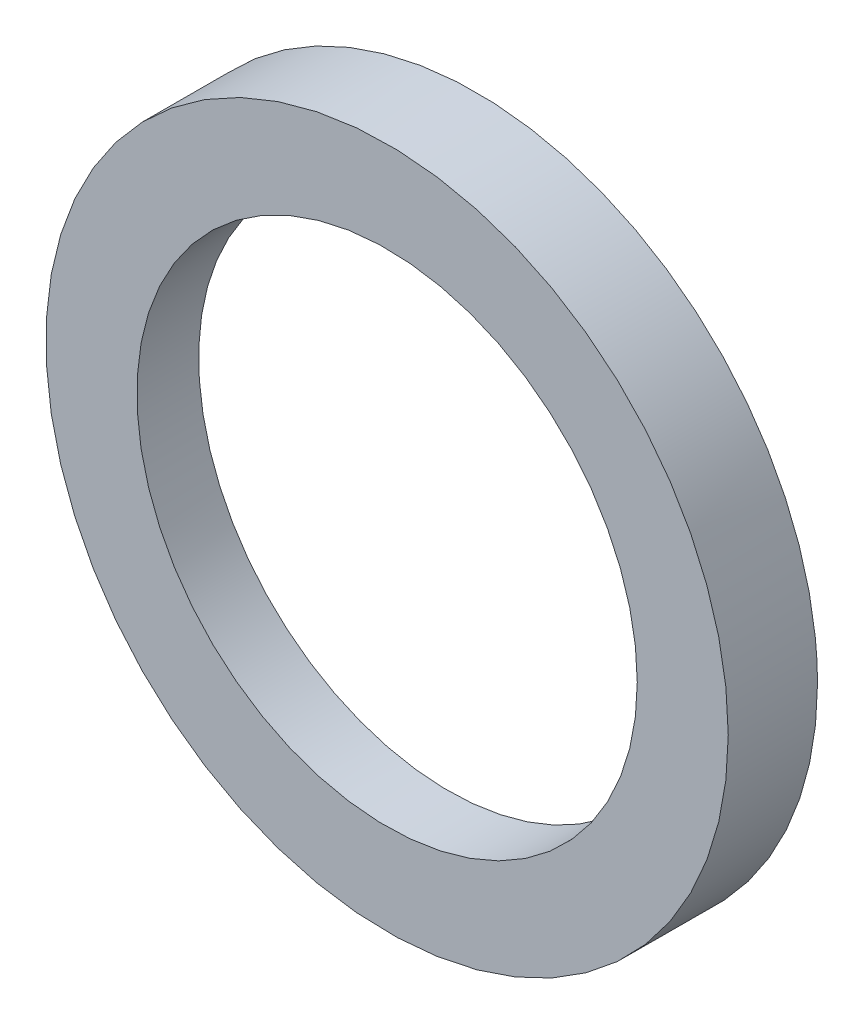
ISO-10303-21;
HEADER;
FILE_DESCRIPTION(('STEP AP214'),'2;1');
FILE_NAME('part.step','',(''),(''),'','','');
FILE_SCHEMA(('AUTOMOTIVE_DESIGN { 1 0 10303 214 1 1 1 1 }'));
ENDSEC;
DATA;
#1=APPLICATION_CONTEXT('core data for automotive mechanical design processes');
#2=APPLICATION_PROTOCOL_DEFINITION('international standard','automotive_design',2000,#1);
#3=PRODUCT_CONTEXT('',#1,'mechanical');
#4=PRODUCT('Part','Part','',(#3));
#5=PRODUCT_RELATED_PRODUCT_CATEGORY('part','',(#4));
#6=PRODUCT_DEFINITION_FORMATION('','',#4);
#7=PRODUCT_DEFINITION_CONTEXT('part definition',#1,'design');
#8=PRODUCT_DEFINITION('design','',#6,#7);
#9=PRODUCT_DEFINITION_SHAPE('','',#8);
#10=(LENGTH_UNIT() NAMED_UNIT(*) SI_UNIT(.MILLI.,.METRE.));
#11=(NAMED_UNIT(*) PLANE_ANGLE_UNIT() SI_UNIT($,.RADIAN.));
#12=(NAMED_UNIT(*) SI_UNIT($,.STERADIAN.) SOLID_ANGLE_UNIT());
#13=UNCERTAINTY_MEASURE_WITH_UNIT(LENGTH_MEASURE(1.E-05),#10,'distance_accuracy_value','');
#14=(GEOMETRIC_REPRESENTATION_CONTEXT(3) GLOBAL_UNCERTAINTY_ASSIGNED_CONTEXT((#13)) GLOBAL_UNIT_ASSIGNED_CONTEXT((#10,
#11,#12)) REPRESENTATION_CONTEXT('',''));
#15=CARTESIAN_POINT('',(0.,0.,0.));
#16=DIRECTION('',(0.,0.,1.));
#17=DIRECTION('',(1.,0.,0.));
#18=AXIS2_PLACEMENT_3D('',#15,#16,#17);
#19=CARTESIAN_POINT('',(0.,0.,10.6862696659689));
#20=DIRECTION('',(0.,0.,1.));
#21=DIRECTION('',(1.,0.,0.));
#22=AXIS2_PLACEMENT_3D('',#19,#20,#21);
#23=CYLINDRICAL_SURFACE('',#22,15.);
#24=CARTESIAN_POINT('',(0.,0.,17.35));
#25=DIRECTION('',(0.,0.,1.));
#26=DIRECTION('',(1.,0.,0.));
#27=AXIS2_PLACEMENT_3D('',#24,#25,#26);
#28=CIRCLE('',#27,15.);
#29=CARTESIAN_POINT('',(15.,0.,17.35));
#30=VERTEX_POINT('',#29);
#31=EDGE_CURVE('E11',#30,#30,#28,.T.);
#32=ORIENTED_EDGE('',*,*,#31,.F.);
#33=EDGE_LOOP('',(#32));
#34=FACE_BOUND('',#33,.T.);
#35=CARTESIAN_POINT('',(15.,0.,13.4264068711928));
#36=CARTESIAN_POINT('',(15.0000199770271,-0.245375497034634,13.4264016858656));
#37=CARTESIAN_POINT('',(14.9940151572913,-0.490753610266504,13.4263941756303));
#38=CARTESIAN_POINT('',(14.9699739919427,-0.980521236956322,13.4263883649765));
#39=CARTESIAN_POINT('',(14.9519571377994,-1.22491170772843,13.4263900496695));
#40=CARTESIAN_POINT('',(14.9038844137134,-1.71276826250471,13.4264163961721));
#41=CARTESIAN_POINT('',(14.8738157353264,-1.95623308396081,13.4264410824643));
#42=CARTESIAN_POINT('',(14.8017087579735,-2.4423077301061,13.426467444998));
#43=CARTESIAN_POINT('',(14.7596263284263,-2.68491100057215,13.4264690352615));
#44=CARTESIAN_POINT('',(14.6639170774719,-3.16649439026174,13.4264398724091));
#45=CARTESIAN_POINT('',(14.6103526551995,-3.40548690024482,13.4264092907541));
#46=CARTESIAN_POINT('',(14.4914827437983,-3.8804965677055,13.4263904351009));
#47=CARTESIAN_POINT('',(14.4261790768761,-4.11651418088109,13.426402154542));
#48=CARTESIAN_POINT('',(14.2838779248523,-4.58557269050521,13.426448777783));
#49=CARTESIAN_POINT('',(14.2068545800084,-4.81860573725198,13.4264837334434));
#50=CARTESIAN_POINT('',(14.0411387057669,-5.28168496325176,13.426536273815));
#51=CARTESIAN_POINT('',(13.9523944510197,-5.5117126229414,13.4265537784017));
#52=CARTESIAN_POINT('',(13.7643540661647,-5.96585696918062,13.4265383863849));
#53=CARTESIAN_POINT('',(13.6651219265721,-6.19000014637187,13.426505780671));
#54=CARTESIAN_POINT('',(13.4558068363664,-6.63300015490761,13.4264604982461));
#55=CARTESIAN_POINT('',(13.345730401943,-6.85186006363537,13.4264478096437));
#56=CARTESIAN_POINT('',(13.114772272728,-7.28420755137091,13.426444838234));
#57=CARTESIAN_POINT('',(12.9938752515186,-7.49768694320174,13.4264545877068));
#58=CARTESIAN_POINT('',(12.7412697147233,-7.91914660727904,13.4264979687867));
#59=CARTESIAN_POINT('',(12.6095254708261,-8.12710545907023,13.4265316823551));
#60=CARTESIAN_POINT('',(12.3364835944715,-8.53573934869997,13.4265545030027));
#61=CARTESIAN_POINT('',(12.1952161589136,-8.73643457086651,13.4265437451041));
#62=CARTESIAN_POINT('',(11.9032058467781,-9.13049680803047,13.4264987460191));
#63=CARTESIAN_POINT('',(11.7524727107051,-9.32387103836955,13.4264645286249));
#64=CARTESIAN_POINT('',(11.4415577716528,-9.70311212251682,13.4264132175773));
#65=CARTESIAN_POINT('',(11.2813689996461,-9.88897326465012,13.4263961367251));
#66=CARTESIAN_POINT('',(10.9515775846963,-10.2529943159107,13.4264012746602));
#67=CARTESIAN_POINT('',(10.7819523917999,-10.4311337938327,13.4264235918785));
#68=CARTESIAN_POINT('',(10.4350510958588,-10.7779876087998,13.4264604715956));
#69=CARTESIAN_POINT('',(10.2578183110673,-10.9467452886902,13.426475072972));
#70=CARTESIAN_POINT('',(9.89507441021608,-11.2756767533768,13.4264852388528));
#71=CARTESIAN_POINT('',(9.70955133281081,-11.4358373499339,13.4264807749104));
#72=CARTESIAN_POINT('',(9.33028223983738,-11.747350371589,13.4264776012048));
#73=CARTESIAN_POINT('',(9.13651239684372,-11.8986737869173,13.42647890942));
#74=CARTESIAN_POINT('',(8.74086600476507,-12.1923467797364,13.4264648868347));
#75=CARTESIAN_POINT('',(8.53895548377453,-12.3346505878111,13.4264494774024));
#76=CARTESIAN_POINT('',(8.13106307149784,-12.6073184890543,13.4264153564003));
#77=CARTESIAN_POINT('',(7.9251697883041,-12.737815117026,13.4263966909794));
#78=CARTESIAN_POINT('',(7.50642737861764,-12.9889975965783,13.4263988865024));
#79=CARTESIAN_POINT('',(7.29355499142698,-13.1096446796713,13.4264198964582));
#80=CARTESIAN_POINT('',(6.86099207296762,-13.3409611689156,13.4264778110716));
#81=CARTESIAN_POINT('',(6.64127114661918,-13.4515737140972,13.4265148002023));
#82=CARTESIAN_POINT('',(6.19515479601115,-13.6626606780385,13.4265609556781));
#83=CARTESIAN_POINT('',(5.9687237553191,-13.7630598027787,13.4265699281035));
#84=CARTESIAN_POINT('',(5.51402791410604,-13.9514827666865,13.4265417032825));
#85=CARTESIAN_POINT('',(5.28581988227721,-14.0396435745321,13.4265050722969));
#86=CARTESIAN_POINT('',(4.8251056691939,-14.2047131275852,13.4264589244707));
#87=CARTESIAN_POINT('',(4.59259535343477,-14.2816103402894,13.4264494352382));
#88=CARTESIAN_POINT('',(4.12343672544327,-14.4240588252737,13.4264547165827));
#89=CARTESIAN_POINT('',(3.88677890835644,-14.4895787915964,13.4264695529605));
#90=CARTESIAN_POINT('',(3.40947224609954,-14.6091271936941,13.4265211441416));
#91=CARTESIAN_POINT('',(3.16881041415688,-14.6631037480046,13.4265579951896));
#92=CARTESIAN_POINT('',(2.6858609794817,-14.7591213792078,13.4265827361134));
#93=CARTESIAN_POINT('',(2.44358031067962,-14.8011973619296,13.4265707708002));
#94=CARTESIAN_POINT('',(1.95782398199621,-14.8733704005704,13.4265238616404));
#95=CARTESIAN_POINT('',(1.71435249752584,-14.9034955217487,13.4264889721472));
#96=CARTESIAN_POINT('',(1.22634397069575,-14.9517116967635,13.4264361762349));
#97=CARTESIAN_POINT('',(0.981807528743092,-14.9698088220345,13.4264182612456));
#98=CARTESIAN_POINT('',(0.49180361339278,-14.9939606698047,13.4264013039084));
#99=CARTESIAN_POINT('',(0.246335321211981,-14.9999987555947,13.4264022876134));
#100=CARTESIAN_POINT('',(-0.244621729277353,-15.0000343232038,13.4263997423431));
#101=CARTESIAN_POINT('',(-0.490110487648506,-14.9940308393891,13.4263962130058));
#102=CARTESIAN_POINT('',(-0.980159229208044,-14.9699521874844,13.4264059106652));
#103=CARTESIAN_POINT('',(-1.22472002393864,-14.9518935631179,13.4264191147202));
#104=CARTESIAN_POINT('',(-1.71278043788775,-14.9037533574705,13.4264620267347));
#105=CARTESIAN_POINT('',(-1.95627945029845,-14.8736656308832,13.4264917431328));
#106=CARTESIAN_POINT('',(-2.44209670637423,-14.8015799674755,13.426522853894));
#107=CARTESIAN_POINT('',(-2.68441077687857,-14.7595539370425,13.4265241808812));
#108=CARTESIAN_POINT('',(-3.16690647874843,-14.6637010530643,13.4264908050466));
#109=CARTESIAN_POINT('',(-3.40708615952418,-14.6098643702528,13.4264560721238));
#110=CARTESIAN_POINT('',(-3.88372824943949,-14.49052661448,13.4264240816483));
#111=CARTESIAN_POINT('',(-4.12019997907399,-14.4250627873581,13.4264267064896));
#112=CARTESIAN_POINT('',(-4.58929106521987,-14.2826593263272,13.4264545463942));
#113=CARTESIAN_POINT('',(-4.82191545769364,-14.205736275734,13.4264797290726));
#114=CARTESIAN_POINT('',(-5.28317662143682,-14.0405671603567,13.4265311560645));
#115=CARTESIAN_POINT('',(-5.51181231171785,-13.9523180786074,13.4265574006595));
#116=CARTESIAN_POINT('',(-5.96657181411105,-13.7640134648401,13.426560800411));
#117=CARTESIAN_POINT('',(-6.1926547631023,-13.6638592295564,13.4265375136083));
#118=CARTESIAN_POINT('',(-6.63824920654205,-13.4531450815691,13.4264882588646));
#119=CARTESIAN_POINT('',(-6.85779215603014,-13.3426517071947,13.426462307976));
#120=CARTESIAN_POINT('',(-7.29018835274713,-13.1114839397205,13.4264301348457));
#121=CARTESIAN_POINT('',(-7.50306716185626,-12.9908573712782,13.4264238247474));
#122=CARTESIAN_POINT('',(-7.9220056877183,-12.7396112671199,13.426449501555));
#123=CARTESIAN_POINT('',(-8.12808332657684,-12.6090216050106,13.4264813778836));
#124=CARTESIAN_POINT('',(-8.53660118817628,-12.3360538225568,13.426518064495));
#125=CARTESIAN_POINT('',(-8.73894575274793,-12.1935325696605,13.4265224768191));
#126=CARTESIAN_POINT('',(-9.13515396813438,-11.8996438628237,13.4264999262729));
#127=CARTESIAN_POINT('',(-9.32906262045503,-11.7483370862344,13.4264731587986));
#128=CARTESIAN_POINT('',(-9.70830302597491,-11.437077316119,13.4264305602407));
#129=CARTESIAN_POINT('',(-9.8936705388231,-11.277167902863,13.4264146787714));
#130=CARTESIAN_POINT('',(-10.2557712706995,-10.9489336332832,13.4264014549327));
#131=CARTESIAN_POINT('',(-10.4325290337047,-10.7806358487504,13.4264040563296));
#132=CARTESIAN_POINT('',(-10.7792440747884,-10.4339904913696,13.4264115487304));
#133=CARTESIAN_POINT('',(-10.9491217135421,-10.2555632557264,13.4264164610482));
#134=CARTESIAN_POINT('',(-11.2793511914078,-9.89111438564408,13.4264348341146));
#135=CARTESIAN_POINT('',(-11.4397311036492,-9.70511818908261,13.4264482681378));
#136=CARTESIAN_POINT('',(-11.7509314571118,-9.3257257255248,13.4264842092147));
#137=CARTESIAN_POINT('',(-11.9017648276633,-9.13234006189703,13.4265067036793));
#138=CARTESIAN_POINT('',(-12.193897271746,-8.73838717457841,13.4265202077948));
#139=CARTESIAN_POINT('',(-12.3351927822006,-8.5378173094318,13.4265112057449));
#140=CARTESIAN_POINT('',(-12.6080578806949,-8.12969512567761,13.4264691529169));
#141=CARTESIAN_POINT('',(-12.7396113958987,-7.92213205544225,13.4264360633307));
#142=CARTESIAN_POINT('',(-12.991995442144,-7.50116988108807,13.426414019426));
#143=CARTESIAN_POINT('',(-13.1128476484261,-7.2877837748141,13.4264249737061));
#144=CARTESIAN_POINT('',(-13.3438816816623,-6.85533795553526,13.4264687947178));
#145=CARTESIAN_POINT('',(-13.4540644831779,-6.63627876304074,13.426501659446));
#146=CARTESIAN_POINT('',(-13.6637791449991,-6.19260902327883,13.4265607210396));
#147=CARTESIAN_POINT('',(-13.763290191957,-5.9679886430891,13.4265869050078));
#148=CARTESIAN_POINT('',(-13.9515868255456,-5.51354496669467,13.4265802625254));
#149=CARTESIAN_POINT('',(-14.0403410134536,-5.28370865871115,13.4265472675626));
#150=CARTESIAN_POINT('',(-14.2060795814694,-4.82088262211683,13.4264842612369));
#151=CARTESIAN_POINT('',(-14.2831103497671,-4.58790951480785,13.4264542382884));
#152=CARTESIAN_POINT('',(-14.4254553844375,-4.11885382994813,13.4264215275215));
#153=CARTESIAN_POINT('',(-14.4907898686473,-3.8827773902655,13.4264187920779));
#154=CARTESIAN_POINT('',(-14.6097403785441,-3.40753190100197,13.4264569976996));
#155=CARTESIAN_POINT('',(-14.6633488677856,-3.16836096651394,13.4264979667556));
#156=CARTESIAN_POINT('',(-14.7591852693014,-2.6862838514944,13.4265374597817));
#157=CARTESIAN_POINT('',(-14.8013441181098,-2.44336395460766,13.426535731714));
#158=CARTESIAN_POINT('',(-14.8735792518528,-1.95677450899431,13.426500192404));
#159=CARTESIAN_POINT('',(-14.9037055309679,-1.71311239179391,13.4264665159173));
#160=CARTESIAN_POINT('',(-14.9518651738117,-1.22497674477104,13.4264210619224));
#161=CARTESIAN_POINT('',(-14.969917219051,-0.980505059325288,13.4264092505338));
#162=CARTESIAN_POINT('',(-14.9940015167694,-0.490688788413429,13.4263995587927));
#163=CARTESIAN_POINT('',(-15.0000199446609,-0.245343522994723,13.4264016944509));
#164=CARTESIAN_POINT('',(-15.,0.,13.4264068711929));
#165=B_SPLINE_CURVE_WITH_KNOTS('',3,(#35,#36,#37,#38,#39,#40,#41,#42,#43,#44,#45,#46,#47,#48,
#49,#50,#51,#52,#53,#54,#55,#56,#57,#58,#59,#60,#61,#62,#63,#64,#65,#66,#67,#68,#69,#70,#71,#72,
#73,#74,#75,#76,#77,#78,#79,#80,#81,#82,#83,#84,#85,#86,#87,#88,#89,#90,#91,#92,#93,#94,#95,#96,
#97,#98,#99,#100,#101,#102,#103,#104,#105,#106,#107,#108,#109,#110,#111,#112,#113,#114,#115,
#116,#117,#118,#119,#120,#121,#122,#123,#124,#125,#126,#127,#128,#129,#130,#131,#132,#133,#134,
#135,#136,#137,#138,#139,#140,#141,#142,#143,#144,#145,#146,#147,#148,#149,#150,#151,#152,#153,
#154,#155,#156,#157,#158,#159,#160,#161,#162,#163,#164),.UNSPECIFIED.,.F.,.F.,(4,2,2,2,2,2,2,2,
2,2,2,2,2,2,2,2,2,2,2,2,2,2,2,2,2,2,2,2,2,2,2,2,2,2,2,2,2,2,2,2,2,2,2,2,2,2,2,2,2,2,2,2,2,2,2,2,
2,2,2,2,2,2,2,2,4),(0.,0.736056279968159,1.47092108702971,2.2065689738225,2.94495470426688,
3.67942503439743,4.41378145577007,5.14978240122567,5.88914726037371,6.62423629986398,
7.35888629764223,8.09459384802205,8.83282983049748,9.56882606260492,10.3040769628638,
11.0398766956797,11.777517333681,12.5114049183542,13.2463878995827,13.9836617199787,
14.7244184251793,15.4554219691106,16.1891764610102,16.9268583090293,17.6696348846108,
18.4032796535993,19.13767040915,19.8740509714397,20.6136746751525,21.3511059257315,
22.0867950020092,22.8221124380521,23.5584436227521,24.2948338574634,25.030215587958,
25.7659734838951,26.5034773402974,27.2415973192732,27.9773941378993,28.7121363038444,
29.4470745941197,30.1885980931061,30.9256406036805,31.6593814246024,32.3910026648616,
33.133201015808,33.870773105521,34.6049078759426,35.3368100145011,36.0755990050978,
36.8120824250019,37.5475460490584,38.283282918311,39.0202077815576,39.7556041434662,
40.4909332695395,41.2276713962637,41.9665107194644,42.702345957594,43.4368967067293,
44.1719181827094,44.9112794639,45.6475359891214,46.3826507111206,47.1186094712608),.UNSPECIFIED.);
#166=CARTESIAN_POINT('',(15.,0.,13.4264068711929));
#167=VERTEX_POINT('',#166);
#168=CARTESIAN_POINT('',(-15.,0.,13.4264068711928));
#169=VERTEX_POINT('',#168);
#170=EDGE_CURVE('E63',#167,#169,#165,.T.);
#171=ORIENTED_EDGE('',*,*,#170,.F.);
#172=CARTESIAN_POINT('',(-15.,0.,13.4264068711929));
#173=CARTESIAN_POINT('',(-15.0000199770271,0.245375497062535,13.4264016858656));
#174=CARTESIAN_POINT('',(-14.9940151572917,0.490753610322417,13.4263941756297));
#175=CARTESIAN_POINT('',(-14.9699739919431,0.980521237049807,13.4263883649743));
#176=CARTESIAN_POINT('',(-14.9519571378001,1.22491170783152,13.4263900496664));
#177=CARTESIAN_POINT('',(-14.9038844137143,1.71276826260827,13.4264163961675));
#178=CARTESIAN_POINT('',(-14.8738157353281,1.95623308405532,13.4264410824593));
#179=CARTESIAN_POINT('',(-14.8017087579744,2.44230773016304,13.4264674449942));
#180=CARTESIAN_POINT('',(-14.7596263284265,2.68491100060069,13.4264690352595));
#181=CARTESIAN_POINT('',(-14.663917077467,3.16649439025618,13.4264398724112));
#182=CARTESIAN_POINT('',(-14.6103526551889,3.40548690023333,13.4264092907586));
#183=CARTESIAN_POINT('',(-14.491482743781,3.88049656768624,13.4263904351085));
#184=CARTESIAN_POINT('',(-14.4261790768576,4.11651418085996,13.4264021545503));
#185=CARTESIAN_POINT('',(-14.2838779248338,4.58557269048387,13.4264487777916));
#186=CARTESIAN_POINT('',(-14.206854579991,4.81860573723226,13.4264837334515));
#187=CARTESIAN_POINT('',(-14.0411387057565,5.28168496323982,13.42653627382));
#188=CARTESIAN_POINT('',(-13.9523944510153,5.51171262293561,13.4265537784039));
#189=CARTESIAN_POINT('',(-13.7643540661856,5.96585696914679,13.4265383863826));
#190=CARTESIAN_POINT('',(-13.6651219266145,6.19000014630466,13.426505780667));
#191=CARTESIAN_POINT('',(-13.4558068364373,6.63300015479564,13.426460498241));
#192=CARTESIAN_POINT('',(-13.3457304020199,6.85186006351149,13.4264478096394));
#193=CARTESIAN_POINT('',(-13.1147722728043,7.2842075512463,13.4264448382319));
#194=CARTESIAN_POINT('',(-12.9938752515871,7.49768694308771,13.426454587706));
#195=CARTESIAN_POINT('',(-12.7412697147653,7.91914660721097,13.426497968787));
#196=CARTESIAN_POINT('',(-12.6095254708481,8.12710545903687,13.4265316823551));
#197=CARTESIAN_POINT('',(-12.3364835945026,8.53573934865403,13.4265545030025));
#198=CARTESIAN_POINT('',(-12.1952161589774,8.73643457077585,13.4265437451041));
#199=CARTESIAN_POINT('',(-11.9032058468859,9.13049680788018,13.4264987460211));
#200=CARTESIAN_POINT('',(-11.7524727108227,9.32387103820328,13.4264645286287));
#201=CARTESIAN_POINT('',(-11.4415577717697,9.70311212234943,13.4264132175841));
#202=CARTESIAN_POINT('',(-11.281368999751,9.88897326449644,13.4263961367331));
#203=CARTESIAN_POINT('',(-10.95157758476,10.2529943158189,13.4264012746662));
#204=CARTESIAN_POINT('',(-10.7819523918331,10.4311337937879,13.4264235918814));
#205=CARTESIAN_POINT('',(-10.4350510959183,10.7779876087519,13.4264604715927));
#206=CARTESIAN_POINT('',(-10.2578183111882,10.9467452885967,13.4264750729664));
#207=CARTESIAN_POINT('',(-9.89507441041854,11.2756767532225,13.4264852388465));
#208=CARTESIAN_POINT('',(-9.70955133303179,11.4358373497624,13.4264807749059));
#209=CARTESIAN_POINT('',(-9.33028224005767,11.7473503714168,13.4264776012042));
#210=CARTESIAN_POINT('',(-9.13651239704321,11.8986737867598,13.4264789094213));
#211=CARTESIAN_POINT('',(-8.74086600488493,12.1923467796421,13.4264648868376));
#212=CARTESIAN_POINT('',(-8.5389554838341,12.3346505877632,13.4264494774048));
#213=CARTESIAN_POINT('',(-8.13106307143165,12.6073184891066,13.4264153563979));
#214=CARTESIAN_POINT('',(-7.92516978817219,12.7378151171316,13.4263966909728));
#215=CARTESIAN_POINT('',(-7.50642737839679,12.9889975967526,13.4263988864883));
#216=CARTESIAN_POINT('',(-7.29355499118434,13.1096446798633,13.4264198964407));
#217=CARTESIAN_POINT('',(-6.86099207272537,13.3409611691084,13.42647781105));
#218=CARTESIAN_POINT('',(-6.64127114640037,13.4515737142754,13.4265148001799));
#219=CARTESIAN_POINT('',(-6.19515479587927,13.6626606781445,13.4265609556627));
#220=CARTESIAN_POINT('',(-5.96872375525181,13.7630598028294,13.426569928096));
#221=CARTESIAN_POINT('',(-5.51402791399101,13.9514827667115,13.4265417032899));
#222=CARTESIAN_POINT('',(-5.28581988204614,14.0396435745777,13.4265050723113));
#223=CARTESIAN_POINT('',(-4.82510566880906,14.2047131276581,13.4264589244902));
#224=CARTESIAN_POINT('',(-4.5925953530135,14.2816103403727,13.426449435256));
#225=CARTESIAN_POINT('',(-4.12343672502355,14.4240588253569,13.426454716595));
#226=CARTESIAN_POINT('',(-3.88677890797584,14.4895787916729,13.426469552969));
#227=CARTESIAN_POINT('',(-3.40947224587113,14.6091271937375,13.4265211441444));
#228=CARTESIAN_POINT('',(-3.16881041404248,14.6631037480252,13.4265579951903));
#229=CARTESIAN_POINT('',(-2.6858609794821,14.7591213792097,13.4265827361127));
#230=CARTESIAN_POINT('',(-2.44358031067972,14.80119736193,13.4265707708));
#231=CARTESIAN_POINT('',(-1.95782398199609,14.8733704005699,13.4265238616406));
#232=CARTESIAN_POINT('',(-1.71435249752581,14.9034955217485,13.4264889721472));
#233=CARTESIAN_POINT('',(-1.22634397069577,14.9517116967637,13.4264361762348));
#234=CARTESIAN_POINT('',(-0.981807528743095,14.9698088220346,13.4264182612456));
#235=CARTESIAN_POINT('',(-0.491803613392765,14.9939606698047,13.4264013039084));
#236=CARTESIAN_POINT('',(-0.24633532121197,14.9999987555946,13.4264022876134));
#237=CARTESIAN_POINT('',(0.244621729284041,15.000034323204,13.426399742343));
#238=CARTESIAN_POINT('',(0.490110487661875,14.9940308393892,13.4263962130057));
#239=CARTESIAN_POINT('',(0.980159229230358,14.9699521874843,13.4264059106647));
#240=CARTESIAN_POINT('',(1.22472002396323,14.9518935631178,13.4264191147196));
#241=CARTESIAN_POINT('',(1.71278043791246,14.9037533574705,13.4264620267337));
#242=CARTESIAN_POINT('',(1.95627945032104,14.8736656308835,13.4264917431316));
#243=CARTESIAN_POINT('',(2.44209670638774,14.8015799674752,13.4265228538933));
#244=CARTESIAN_POINT('',(2.68441077688517,14.7595539370414,13.4265241808812));
#245=CARTESIAN_POINT('',(3.16690647880108,14.6637010530536,13.4264908050467));
#246=CARTESIAN_POINT('',(3.40708615962924,14.6098643702302,13.4264560721235));
#247=CARTESIAN_POINT('',(3.88372824961449,14.4905266144403,13.4264240816459));
#248=CARTESIAN_POINT('',(4.12019997926697,14.4250627873149,13.4264267064856));
#249=CARTESIAN_POINT('',(4.58929106541362,14.2826593262843,13.4264545463876));
#250=CARTESIAN_POINT('',(4.82191545787072,14.2057362756964,13.426479729065));
#251=CARTESIAN_POINT('',(5.28317662154284,14.0405671603326,13.4265311560589));
#252=CARTESIAN_POINT('',(5.51181231177008,13.9523180785931,13.4265574006571));
#253=CARTESIAN_POINT('',(5.96657181422172,13.7640134647868,13.4265608004135));
#254=CARTESIAN_POINT('',(6.19265476332192,13.6638592294465,13.4265375136124));
#255=CARTESIAN_POINT('',(6.63824920690691,13.4531450813825,13.4264882588669));
#256=CARTESIAN_POINT('',(6.85779215643299,13.3426517069916,13.426462307975));
#257=CARTESIAN_POINT('',(7.29018835315131,13.1114839395182,13.4264301348385));
#258=CARTESIAN_POINT('',(7.5030671622257,12.9908573710967,13.4264238247374));
#259=CARTESIAN_POINT('',(7.92200568793938,12.7396112670091,13.4264495015463));
#260=CARTESIAN_POINT('',(8.12808332668639,12.6090216049533,13.426481377879));
#261=CARTESIAN_POINT('',(8.53660118823101,12.336053822504,13.4265180644997));
#262=CARTESIAN_POINT('',(8.73894575285397,12.1935325695509,13.4265224768292));
#263=CARTESIAN_POINT('',(9.13515396830962,11.8996438626396,13.426499926287));
#264=CARTESIAN_POINT('',(9.32906262064954,11.7483370860345,13.4264731588114));
#265=CARTESIAN_POINT('',(9.70830302617011,11.4370773159203,13.4264305602495));
#266=CARTESIAN_POINT('',(9.89367053900125,11.2771679026831,13.4264146787776));
#267=CARTESIAN_POINT('',(10.2557712708056,10.9489336331746,13.4264014549347));
#268=CARTESIAN_POINT('',(10.4325290337575,10.7806358486959,13.42640405633));
#269=CARTESIAN_POINT('',(10.7792440747828,10.4339904913772,13.4264115487299));
#270=CARTESIAN_POINT('',(10.9491217135291,10.2555632557397,13.4264164610483));
#271=CARTESIAN_POINT('',(11.2793511913856,9.89111438566553,13.4264348341155));
#272=CARTESIAN_POINT('',(11.4397311036249,9.70511818910634,13.4264482681389));
#273=CARTESIAN_POINT('',(11.7509314570875,9.32572572554853,13.4264842092162));
#274=CARTESIAN_POINT('',(11.9017648276408,9.13234006191829,13.4265067036811));
#275=CARTESIAN_POINT('',(12.1938972717326,8.73838717459128,13.426520207796));
#276=CARTESIAN_POINT('',(12.3351927821943,8.53781730943857,13.4265112057454));
#277=CARTESIAN_POINT('',(12.6080578806806,8.12969512570143,13.4264691529164));
#278=CARTESIAN_POINT('',(12.7396113958708,7.92213205549024,13.42643606333));
#279=CARTESIAN_POINT('',(12.9919954420981,7.50116988116816,13.4264140194258));
#280=CARTESIAN_POINT('',(13.112847648375,7.28778377490167,13.4264249737067));
#281=CARTESIAN_POINT('',(13.3438816816109,6.85533795562237,13.42646879472));
#282=CARTESIAN_POINT('',(13.4540644831306,6.6362787631195,13.4265016594488));
#283=CARTESIAN_POINT('',(13.6637791449708,6.19260902332607,13.426560721042));
#284=CARTESIAN_POINT('',(13.7632901919429,5.9679886431128,13.4265869050092));
#285=CARTESIAN_POINT('',(13.9515868255526,5.51354496668815,13.426580262524));
#286=CARTESIAN_POINT('',(14.0403410134685,5.28370865869832,13.4265472675593));
#287=CARTESIAN_POINT('',(14.206079581494,4.82088262209535,13.4264842612311));
#288=CARTESIAN_POINT('',(14.2831103497939,4.58790951478414,13.4264542382819));
#289=CARTESIAN_POINT('',(14.4254553844644,4.11885382992445,13.4264215275146));
#290=CARTESIAN_POINT('',(14.4907898686725,3.88277739024416,13.4264187920712));
#291=CARTESIAN_POINT('',(14.6097403785592,3.40753190098913,13.4264569976954));
#292=CARTESIAN_POINT('',(14.6633488677926,3.16836096650731,13.4264979667536));
#293=CARTESIAN_POINT('',(14.7591852693013,2.68628385146587,13.4265374597837));
#294=CARTESIAN_POINT('',(14.8013441181089,2.44336395455068,13.4265357317177));
#295=CARTESIAN_POINT('',(14.873579251851,1.95677450889968,13.4265001924091));
#296=CARTESIAN_POINT('',(14.9037055309669,1.71311239169023,13.4264665159219));
#297=CARTESIAN_POINT('',(14.951865173811,1.22497674466784,13.4264210619256));
#298=CARTESIAN_POINT('',(14.9699172190507,0.980505059231708,13.426409250536));
#299=CARTESIAN_POINT('',(14.9940015167689,0.490688788357464,13.4263995587933));
#300=CARTESIAN_POINT('',(15.0000199446608,0.245343522966799,13.426401694451));
#301=CARTESIAN_POINT('',(15.,0.,13.4264068711928));
#302=B_SPLINE_CURVE_WITH_KNOTS('',3,(#172,#173,#174,#175,#176,#177,#178,#179,#180,#181,#182,
#183,#184,#185,#186,#187,#188,#189,#190,#191,#192,#193,#194,#195,#196,#197,#198,#199,#200,#201,
#202,#203,#204,#205,#206,#207,#208,#209,#210,#211,#212,#213,#214,#215,#216,#217,#218,#219,#220,
#221,#222,#223,#224,#225,#226,#227,#228,#229,#230,#231,#232,#233,#234,#235,#236,#237,#238,#239,
#240,#241,#242,#243,#244,#245,#246,#247,#248,#249,#250,#251,#252,#253,#254,#255,#256,#257,#258,
#259,#260,#261,#262,#263,#264,#265,#266,#267,#268,#269,#270,#271,#272,#273,#274,#275,#276,#277,
#278,#279,#280,#281,#282,#283,#284,#285,#286,#287,#288,#289,#290,#291,#292,#293,#294,#295,#296,
#297,#298,#299,#300,#301),.UNSPECIFIED.,.F.,.F.,(4,2,2,2,2,2,2,2,2,2,2,2,2,2,2,2,2,2,2,2,2,2,2,
2,2,2,2,2,2,2,2,2,2,2,2,2,2,2,2,2,2,2,2,2,2,2,2,2,2,2,2,2,2,2,2,2,2,2,2,2,2,2,2,2,4),(0.,
0.736056280052021,1.47092108714221,2.20656897390764,2.94495470426823,3.67942503438527,
4.41378145575365,5.14978240121315,5.8891472603721,6.62423629974465,7.3588862974826,
8.09459384790161,8.83282983049697,9.56882606243816,10.304076962641,11.0398766955119,
11.7775173336786,12.5114049181241,13.2463878992764,13.9836617197488,14.7244184251779,
15.4554219693612,16.1891764613437,16.9268583092794,17.6696348846161,18.4032796539521,
19.1376704096171,19.8740509717883,20.6136746751525,21.3511059257316,22.0867950020093,
22.8221124380522,23.5584436227522,24.2948338574835,25.0302155879849,25.7659734839155,
26.5034773402977,27.2415973194347,27.9773941381157,28.7121363040078,29.447074594122,
30.1885980934761,30.9256406041748,31.6593814249748,32.3910026648653,33.133201016036,
33.8707731058245,34.6049078761702,35.336810014501,36.0755990050699,36.8120824249648,
37.5475460490305,38.2832829183104,39.0202077814739,39.7556041433552,40.4909332694565,
41.2276713962626,41.9665107194894,42.7023459576273,43.4368967067541,44.1719181827107,
44.9112794639851,45.647535989234,46.3826507112045,47.1186094712607),.UNSPECIFIED.);
#303=EDGE_CURVE('E55',#169,#167,#302,.T.);
#304=ORIENTED_EDGE('',*,*,#303,.F.);
#305=EDGE_LOOP('',(#171,#304));
#306=FACE_BOUND('',#305,.T.);
#307=ADVANCED_FACE('F38',(#34,#306),#23,.T.);
#308=CARTESIAN_POINT('',(0.,0.,17.35));
#309=DIRECTION('',(0.,0.,1.));
#310=DIRECTION('',(1.,0.,0.));
#311=AXIS2_PLACEMENT_3D('',#308,#309,#310);
#312=PLANE('',#311);
#313=CARTESIAN_POINT('',(0.,0.,17.35));
#314=DIRECTION('',(0.,0.,1.));
#315=DIRECTION('',(1.,0.,0.));
#316=AXIS2_PLACEMENT_3D('',#313,#314,#315);
#317=CIRCLE('',#316,11.);
#318=CARTESIAN_POINT('',(11.,0.,17.35));
#319=VERTEX_POINT('',#318);
#320=EDGE_CURVE('E103',#319,#319,#317,.T.);
#321=ORIENTED_EDGE('',*,*,#320,.F.);
#322=EDGE_LOOP('',(#321));
#323=FACE_BOUND('',#322,.T.);
#324=ORIENTED_EDGE('',*,*,#31,.T.);
#325=EDGE_LOOP('',(#324));
#326=FACE_BOUND('',#325,.T.);
#327=ADVANCED_FACE('F85',(#323,#326),#312,.T.);
#328=CARTESIAN_POINT('',(45.,0.,-29.));
#329=CARTESIAN_POINT('',(45.,45.,-29.));
#330=CARTESIAN_POINT('',(0.,45.,-29.));
#331=CARTESIAN_POINT('',(-45.,45.,-29.));
#332=CARTESIAN_POINT('',(-45.,0.,-29.));
#333=CARTESIAN_POINT('',(45.,0.,-29.));
#334=CARTESIAN_POINT('',(45.,45.,16.));
#335=CARTESIAN_POINT('',(0.,45.,16.));
#336=CARTESIAN_POINT('',(-45.,45.,16.));
#337=CARTESIAN_POINT('',(-45.,0.,-29.));
#338=CARTESIAN_POINT('',(45.,0.,-29.));
#339=CARTESIAN_POINT('',(45.,0.,16.));
#340=CARTESIAN_POINT('',(0.,0.,16.));
#341=CARTESIAN_POINT('',(-45.,0.,16.));
#342=CARTESIAN_POINT('',(-45.,0.,-29.));
#343=CARTESIAN_POINT('',(45.,0.,-29.));
#344=CARTESIAN_POINT('',(45.,-45.,16.));
#345=CARTESIAN_POINT('',(0.,-45.,16.));
#346=CARTESIAN_POINT('',(-45.,-45.,16.));
#347=CARTESIAN_POINT('',(-45.,0.,-29.));
#348=CARTESIAN_POINT('',(45.,0.,-29.));
#349=CARTESIAN_POINT('',(45.,-45.,-29.));
#350=CARTESIAN_POINT('',(0.,-45.,-29.));
#351=CARTESIAN_POINT('',(-45.,-45.,-29.));
#352=CARTESIAN_POINT('',(-45.,0.,-29.));
#353=(BOUNDED_SURFACE() B_SPLINE_SURFACE(2,2,((#328,#329,#330,#331,#332),(#333,#334,#335,#336,
#337),(#338,#339,#340,#341,#342),(#343,#344,#345,#346,#347),(#348,#349,#350,#351,#352)),
.UNSPECIFIED.,.F.,.F.,.F.) B_SPLINE_SURFACE_WITH_KNOTS((3,2,3),(3,2,3),(0.,0.5,1.),(0.,0.5,1.),
.UNSPECIFIED.) GEOMETRIC_REPRESENTATION_ITEM() RATIONAL_B_SPLINE_SURFACE(((1.,0.707106781186548,
1.,0.707106781186548,1.),(0.707106781186548,0.5,0.707106781186548,0.5,0.707106781186548),(1.,
0.707106781186548,1.,0.707106781186548,1.),(0.707106781186548,0.5,0.707106781186548,0.5,
0.707106781186548),(1.,0.707106781186548,1.,0.707106781186548,1.))) REPRESENTATION_ITEM('') SURFACE());
#354=CARTESIAN_POINT('',(11.,0.,14.6348484585429));
#355=CARTESIAN_POINT('',(11.0000022174602,-0.3090486535406,14.6348484585508));
#356=CARTESIAN_POINT('',(10.9869704086748,-0.618060916936607,14.6348484585714));
#357=CARTESIAN_POINT('',(10.9349341462535,-1.23399218135941,14.634848458561));
#358=CARTESIAN_POINT('',(10.8959228598243,-1.54091061023315,14.6348484585301));
#359=CARTESIAN_POINT('',(10.7921393548934,-2.15069574748697,14.6348484585556));
#360=CARTESIAN_POINT('',(10.7273394483938,-2.45355773823002,14.6348484586122));
#361=CARTESIAN_POINT('',(10.5724413961579,-3.05274192434672,14.6348484586143));
#362=CARTESIAN_POINT('',(10.4823433418695,-3.34906414335618,14.6348484585598));
#363=CARTESIAN_POINT('',(10.2775396933169,-3.93291748163885,14.6348484585259));
#364=CARTESIAN_POINT('',(10.1628460343907,-4.22045278782944,14.6348484585464));
#365=CARTESIAN_POINT('',(9.90963903740961,-4.78484249008158,14.6348484585559));
#366=CARTESIAN_POINT('',(9.77112532323649,-5.06169671740454,14.634848458545));
#367=CARTESIAN_POINT('',(9.47130274147907,-5.60268147264384,14.6348484585407));
#368=CARTESIAN_POINT('',(9.30999969259944,-5.86681522541375,14.6348484585475));
#369=CARTESIAN_POINT('',(8.96571899542949,-6.38055618383289,14.6348484585485));
#370=CARTESIAN_POINT('',(8.78274143193786,-6.63016344630939,14.6348484585427));
#371=CARTESIAN_POINT('',(8.39639118415383,-7.11310408946298,14.634848458543));
#372=CARTESIAN_POINT('',(8.1930163343959,-7.34643573778149,14.634848458549));
#373=CARTESIAN_POINT('',(7.76733333506745,-7.79513744430436,14.634848458549));
#374=CARTESIAN_POINT('',(7.54502516631002,-8.0105074843061,14.6348484585429));
#375=CARTESIAN_POINT('',(7.08304711571727,-8.42176263615897,14.6348484585428));
#376=CARTESIAN_POINT('',(6.84337655846429,-8.6176469892894,14.6348484585486));
#377=CARTESIAN_POINT('',(6.34838541065333,-8.98852852244914,14.6348484585487));
#378=CARTESIAN_POINT('',(6.09306482315936,-9.16352570656778,14.6348484585428));
#379=CARTESIAN_POINT('',(5.56859369290525,-9.49138572862084,14.6348484585429));
#380=CARTESIAN_POINT('',(5.29944340703939,-9.64424897750406,14.6348484585488));
#381=CARTESIAN_POINT('',(4.74922201513748,-9.92675823298838,14.6348484585488));
#382=CARTESIAN_POINT('',(4.46815090888169,-10.0564042391615,14.6348484585429));
#383=CARTESIAN_POINT('',(3.89608671280227,-10.2915570594062,14.6348484585429));
#384=CARTESIAN_POINT('',(3.6050936430523,-10.3970639223116,14.6348484585487));
#385=CARTESIAN_POINT('',(3.01525376313903,-10.5831887029867,14.6348484585487));
#386=CARTESIAN_POINT('',(2.7164069529848,-10.6638066207851,14.6348484585429));
#387=CARTESIAN_POINT('',(2.1129836325914,-10.7995804970942,14.6348484585429));
#388=CARTESIAN_POINT('',(1.80840711140688,-10.8547364069601,14.6348484585487));
#389=CARTESIAN_POINT('',(1.19569028451588,-10.9391939140217,14.6348484585487));
#390=CARTESIAN_POINT('',(0.887549978810425,-10.968495511225,14.6348484585429));
#391=CARTESIAN_POINT('',(0.269896837474973,-11.0010360465363,14.6348484585429));
#392=CARTESIAN_POINT('',(-0.0396159956774795,-11.0042750316709,14.6348484585487));
#393=CARTESIAN_POINT('',(-0.65781429760627,-10.9846674391713,14.6348484585487));
#394=CARTESIAN_POINT('',(-0.966499766383611,-10.9618208615689,14.6348484585429));
#395=CARTESIAN_POINT('',(-1.58084888997057,-10.8902045553798,14.6348484585429));
#396=CARTESIAN_POINT('',(-1.88651254365072,-10.8414348171043,14.6348484585487));
#397=CARTESIAN_POINT('',(-2.49264483703016,-10.7183189067959,14.6348484585487));
#398=CARTESIAN_POINT('',(-2.79311347672257,-10.6439727347292,14.6348484585429));
#399=CARTESIAN_POINT('',(-3.38671990597126,-10.4702324210928,14.6348484585429));
#400=CARTESIAN_POINT('',(-3.67985768778162,-10.3708382530582,14.6348484585487));
#401=CARTESIAN_POINT('',(-4.25671803573387,-10.1477086200735,14.6348484585487));
#402=CARTESIAN_POINT('',(-4.54044060187093,-10.023973155111,14.6348484585429));
#403=CARTESIAN_POINT('',(-5.096453328123,-9.75304065845663,14.6348484585429));
#404=CARTESIAN_POINT('',(-5.3687434919637,-9.60584363441069,14.6348484585487));
#405=CARTESIAN_POINT('',(-5.89995569089425,-9.28903447385601,14.6348484585487));
#406=CARTESIAN_POINT('',(-6.15887772599387,-9.11942233736367,14.6348484585429));
#407=CARTESIAN_POINT('',(-6.66151278442773,-8.75898886610437,14.6348484585429));
#408=CARTESIAN_POINT('',(-6.90522581392255,-8.56816753992853,14.6348484585487));
#409=CARTESIAN_POINT('',(-7.37571032245997,-8.16667225818617,14.6348484585487));
#410=CARTESIAN_POINT('',(-7.60248180150454,-7.95599830262196,14.6348484585429));
#411=CARTESIAN_POINT('',(-8.03747103032042,-7.51629549688591,14.6348484585429));
#412=CARTESIAN_POINT('',(-8.24568877754581,-7.28726664419544,14.6348484585487));
#413=CARTESIAN_POINT('',(-8.64209020456146,-6.81248232702728,14.6348484585487));
#414=CARTESIAN_POINT('',(-8.83027388434669,-6.5667268625454,14.6348484585429));
#415=CARTESIAN_POINT('',(-9.18526932662853,-6.06023646255715,14.6348484585429));
#416=CARTESIAN_POINT('',(-9.35208108633024,-5.79950152509187,14.6348484585487));
#417=CARTESIAN_POINT('',(-9.663146727791,-5.26490587779554,14.6348484585487));
#418=CARTESIAN_POINT('',(-9.80740060954925,-4.99104516796404,14.6348484585429));
#419=CARTESIAN_POINT('',(-10.0723249306359,-4.43214497375074,14.6348484585429));
#420=CARTESIAN_POINT('',(-10.1929953709753,-4.14710548984819,14.6348484585487));
#421=CARTESIAN_POINT('',(-10.409894922353,-3.56787419652012,14.6348484585487));
#422=CARTESIAN_POINT('',(-10.5061240333932,-3.27368238709531,14.6348484585429));
#423=CARTESIAN_POINT('',(-10.6734567910527,-2.67823798374004,14.6348484585429));
#424=CARTESIAN_POINT('',(-10.7445604388047,-2.37698539012788,14.6348484585487));
#425=CARTESIAN_POINT('',(-10.8611367716187,-1.76956113095518,14.6348484585487));
#426=CARTESIAN_POINT('',(-10.9066094566814,-1.46338946539478,14.6348484585429));
#427=CARTESIAN_POINT('',(-10.971600580586,-0.848303759324699,14.6348484585429));
#428=CARTESIAN_POINT('',(-10.991119019428,-0.539389718815021,14.6348484585487));
#429=CARTESIAN_POINT('',(-11.0040628864931,0.0789845435126238,14.6348484585487));
#430=CARTESIAN_POINT('',(-10.9974883147155,0.388444765330606,14.6348484585429));
#431=CARTESIAN_POINT('',(-10.9582929009174,1.00571132753063,14.6348484585429));
#432=CARTESIAN_POINT('',(-10.9256720577227,1.31351766783812,14.6348484585487));
#433=CARTESIAN_POINT('',(-10.8346160142834,1.9252881341991,14.6348484585487));
#434=CARTESIAN_POINT('',(-10.7761808140367,2.22925226025229,14.6348484585429));
#435=CARTESIAN_POINT('',(-10.6339114927215,2.83117730808414,14.6348484585429));
#436=CARTESIAN_POINT('',(-10.550077370564,3.12913822960544,14.6348484585487));
#437=CARTESIAN_POINT('',(-10.3576062167553,3.71693853103198,14.6348484585487));
#438=CARTESIAN_POINT('',(-10.2489691851051,4.00677791093752,14.6348484585429));
#439=CARTESIAN_POINT('',(-10.0076645724209,4.57627450725612,14.6348484585429));
#440=CARTESIAN_POINT('',(-9.87499699452954,4.85593172500074,14.6348484585487));
#441=CARTESIAN_POINT('',(-9.58657446675293,5.40307584188388,14.6348484585487));
#442=CARTESIAN_POINT('',(-9.43081951687346,5.67056274102546,14.6348484585429));
#443=CARTESIAN_POINT('',(-9.09732959223495,6.19146451364923,14.6348484585429));
#444=CARTESIAN_POINT('',(-8.91959462049197,6.44487938906237,14.6348484585487));
#445=CARTESIAN_POINT('',(-8.54340822391201,6.93583552667881,14.6348484585487));
#446=CARTESIAN_POINT('',(-8.3449567990726,7.17337678888028,14.6348484585429));
#447=CARTESIAN_POINT('',(-7.9287482820593,7.63089701743462,14.6348484585429));
#448=CARTESIAN_POINT('',(-7.71099118206539,7.85087597667361,14.6348484585487));
#449=CARTESIAN_POINT('',(-7.25771950649079,8.27170757318911,14.6348484585487));
#450=CARTESIAN_POINT('',(-7.02220493089711,8.47256021045164,14.6348484585429));
#451=CARTESIAN_POINT('',(-6.53509259298789,8.85371128254019,14.6348484585429));
#452=CARTESIAN_POINT('',(-6.28349482543098,9.03400971066774,14.6348484585487));
#453=CARTESIAN_POINT('',(-5.76600488389036,9.37277047368457,14.6348484585487));
#454=CARTESIAN_POINT('',(-5.50011270991399,9.53123280858506,14.6348484585429));
#455=CARTESIAN_POINT('',(-4.95592457932421,9.82519465636984,14.6348484585429));
#456=CARTESIAN_POINT('',(-4.67762863581659,9.96069419351585,14.6348484585487));
#457=CARTESIAN_POINT('',(-4.11061122022153,10.2077673301786,14.6348484585487));
#458=CARTESIAN_POINT('',(-3.82188974814787,10.319340929727,14.6348484585428));
#459=CARTESIAN_POINT('',(-3.2360740192481,10.5177689336424,14.6348484585428));
#460=CARTESIAN_POINT('',(-2.93897976555141,10.6046233472484,14.6348484585487));
#461=CARTESIAN_POINT('',(-2.33853052816966,10.7529955532674,14.6348484585487));
#462=CARTESIAN_POINT('',(-2.035175544477,10.8145133456496,14.6348484585429));
#463=CARTESIAN_POINT('',(-1.42436096404289,10.9117750429873,14.6348484585429));
#464=CARTESIAN_POINT('',(-1.11690135989619,10.9475189014369,14.6348484585487));
#465=CARTESIAN_POINT('',(-0.500063932750665,10.9929784320871,14.6348484585487));
#466=CARTESIAN_POINT('',(-0.190686109751286,11.0026941042803,14.6348484585429));
#467=CARTESIAN_POINT('',(0.427787668796479,10.9960281961329,14.6348484585429));
#468=CARTESIAN_POINT('',(0.736883624882236,10.9796466656505,14.6348484585487));
#469=CARTESIAN_POINT('',(1.35259677959399,10.92090290826,14.6348484585487));
#470=CARTESIAN_POINT('',(1.65921397821714,10.8785406813219,14.6348484585429));
#471=CARTESIAN_POINT('',(2.26779037404591,10.7681365883495,14.6348484585429));
#472=CARTESIAN_POINT('',(2.56974956182697,10.7000946703643,14.6348484585488));
#473=CARTESIAN_POINT('',(3.16686254046507,10.5388149435456,14.6348484585488));
#474=CARTESIAN_POINT('',(3.46201633144756,10.4455771351765,14.6348484585429));
#475=CARTESIAN_POINT('',(4.04342555544531,10.2345665316965,14.6348484585428));
#476=CARTESIAN_POINT('',(4.32968082312355,10.1167932810231,14.6348484585487));
#477=CARTESIAN_POINT('',(4.89125214028788,9.85755014458849,14.6348484585486));
#478=CARTESIAN_POINT('',(5.16656818763225,9.71608025418792,14.6348484585428));
#479=CARTESIAN_POINT('',(5.70429311816242,9.41045561800599,14.6348484585429));
#480=CARTESIAN_POINT('',(5.96670250328561,9.2463017553469,14.634848458549));
#481=CARTESIAN_POINT('',(6.47675983766941,8.89647214968852,14.634848458549));
#482=CARTESIAN_POINT('',(6.72440780188905,8.71079642849979,14.634848458543));
#483=CARTESIAN_POINT('',(7.20315655755183,8.31926378908933,14.6348484585427));
#484=CARTESIAN_POINT('',(7.43425910459541,8.11340901753347,14.6348484585485));
#485=CARTESIAN_POINT('',(7.87830427806196,7.68296406783339,14.6348484585475));
#486=CARTESIAN_POINT('',(8.09124683343515,7.45837381639464,14.6348484585407));
#487=CARTESIAN_POINT('',(8.49750932630079,6.99199535117182,14.634848458545));
#488=CARTESIAN_POINT('',(8.69082424754306,6.75020276769225,14.6348484585559));
#489=CARTESIAN_POINT('',(9.05639194912761,6.25119397529816,14.6348484585464));
#490=CARTESIAN_POINT('',(9.22864506201786,5.99397801000124,14.6348484585259));
#491=CARTESIAN_POINT('',(9.55094598997074,5.4658195423753,14.6348484585598));
#492=CARTESIAN_POINT('',(9.70098300828172,5.19487045121314,14.6348484586143));
#493=CARTESIAN_POINT('',(9.97768437423504,4.64128987933733,14.6348484586122));
#494=CARTESIAN_POINT('',(10.1043486373887,4.35865835639809,14.6348484585556));
#495=CARTESIAN_POINT('',(10.3332796831677,3.78402847048027,14.6348484585301));
#496=CARTESIAN_POINT('',(10.4355725564337,3.49204050749179,14.634848458561));
#497=CARTESIAN_POINT('',(10.6151835421699,2.90058553126525,14.6348484585714));
#498=CARTESIAN_POINT('',(10.6925082169746,2.60112050553489,14.6348484585508));
#499=CARTESIAN_POINT('',(10.8377529196,1.92146127765688,14.634848458533));
#500=CARTESIAN_POINT('',(10.8985439408551,1.53972271213303,14.6348484585429));
#501=CARTESIAN_POINT('',(10.9796660964123,0.771970512586448,14.6348484585429));
#502=CARTESIAN_POINT('',(10.9999972307143,0.385956878563719,14.634848458533));
#503=CARTESIAN_POINT('',(11.,0.,14.6348484585429));
#504=B_SPLINE_CURVE_WITH_KNOTS('',3,(#354,#355,#356,#357,#358,#359,#360,#361,#362,#363,#364,
#365,#366,#367,#368,#369,#370,#371,#372,#373,#374,#375,#376,#377,#378,#379,#380,#381,#382,#383,
#384,#385,#386,#387,#388,#389,#390,#391,#392,#393,#394,#395,#396,#397,#398,#399,#400,#401,#402,
#403,#404,#405,#406,#407,#408,#409,#410,#411,#412,#413,#414,#415,#416,#417,#418,#419,#420,#421,
#422,#423,#424,#425,#426,#427,#428,#429,#430,#431,#432,#433,#434,#435,#436,#437,#438,#439,#440,
#441,#442,#443,#444,#445,#446,#447,#448,#449,#450,#451,#452,#453,#454,#455,#456,#457,#458,#459,
#460,#461,#462,#463,#464,#465,#466,#467,#468,#469,#470,#471,#472,#473,#474,#475,#476,#477,#478,
#479,#480,#481,#482,#483,#484,#485,#486,#487,#488,#489,#490,#491,#492,#493,#494,#495,#496,#497,
#498,#499,#500,#501,#502,#503),.UNSPECIFIED.,.T.,.F.,(4,2,2,2,2,2,2,2,2,2,2,2,2,2,2,2,2,2,2,2,2,
2,2,2,2,2,2,2,2,2,2,2,2,2,2,2,2,2,2,2,2,2,2,2,2,2,2,2,2,2,2,2,2,2,2,2,2,2,2,2,2,2,2,2,2,2,2,2,2,
2,2,2,2,2,4),(0.,0.926808827859474,1.85386150955804,2.7819122198901,3.70995957554651,
4.63755759909861,5.56517027075417,6.49254652557153,7.4199191522706,8.34739033734912,
9.27486246233237,10.2023706864835,11.1298787290447,12.0573695488564,12.9848603857646,
13.912349346327,14.8398383058201,15.7673290372597,16.694819768434,17.6223088260774,
18.5497978825955,19.4772872857691,20.4047766901704,21.3322670745328,22.2597574593708,
23.1872475419469,24.1147376238448,25.0422273300494,25.9697170361462,26.897206869512,
27.8246967031104,28.7521866579997,29.6796766129216,30.607166528081,31.5346564431681,
32.462146316445,33.389636189697,34.317126062949,35.2446159362258,36.1721058513129,
37.0995957664723,38.0270857213942,38.9545756762836,39.8820655098819,40.8095553432477,
41.7370450493445,42.6645347555491,43.592024837447,44.5195149200231,45.4470053048611,
46.3744956892236,47.3019850936248,48.2294744967985,49.1569635533165,50.0844526109599,
51.0119433421342,51.9394340735738,52.8669230330669,53.7944119936293,54.7219028305375,
55.6493936503492,56.5769016929104,57.5044099170616,58.4318820420448,59.3593532271233,
60.2867258538224,61.2141021086397,62.1417147802953,63.0693128038474,63.9973601595038,
64.9254108698359,65.8524635515344,66.7792723793939,67.9367219852339,69.0941715910738),.UNSPECIFIED.);
#505=CARTESIAN_POINT('',(11.,0.,14.6348484585429));
#506=VERTEX_POINT('',#505);
#507=EDGE_CURVE('E45',#506,#506,#504,.T.);
#508=ORIENTED_EDGE('',*,*,#507,.F.);
#509=EDGE_LOOP('',(#508));
#510=FACE_BOUND('',#509,.T.);
#511=ORIENTED_EDGE('',*,*,#170,.T.);
#512=ORIENTED_EDGE('',*,*,#303,.T.);
#513=EDGE_LOOP('',(#511,#512));
#514=FACE_BOUND('',#513,.T.);
#515=ADVANCED_FACE('F40',(#510,#514),#353,.T.);
#516=CARTESIAN_POINT('',(0.,0.,10.8123721914135));
#517=DIRECTION('',(0.,0.,1.));
#518=DIRECTION('',(1.,0.,0.));
#519=AXIS2_PLACEMENT_3D('',#516,#517,#518);
#520=CYLINDRICAL_SURFACE('',#519,11.);
#521=ORIENTED_EDGE('',*,*,#507,.T.);
#522=EDGE_LOOP('',(#521));
#523=FACE_BOUND('',#522,.T.);
#524=ORIENTED_EDGE('',*,*,#320,.T.);
#525=EDGE_LOOP('',(#524));
#526=FACE_BOUND('',#525,.T.);
#527=ADVANCED_FACE('F90',(#523,#526),#520,.F.);
#528=CLOSED_SHELL('',(#307,#327,#515,#527));
#529=MANIFOLD_SOLID_BREP('B2',#528);
#530=ADVANCED_BREP_SHAPE_REPRESENTATION('',(#18,#529),#14);
#531=SHAPE_DEFINITION_REPRESENTATION(#9,#530);
ENDSEC;
END-ISO-10303-21;
